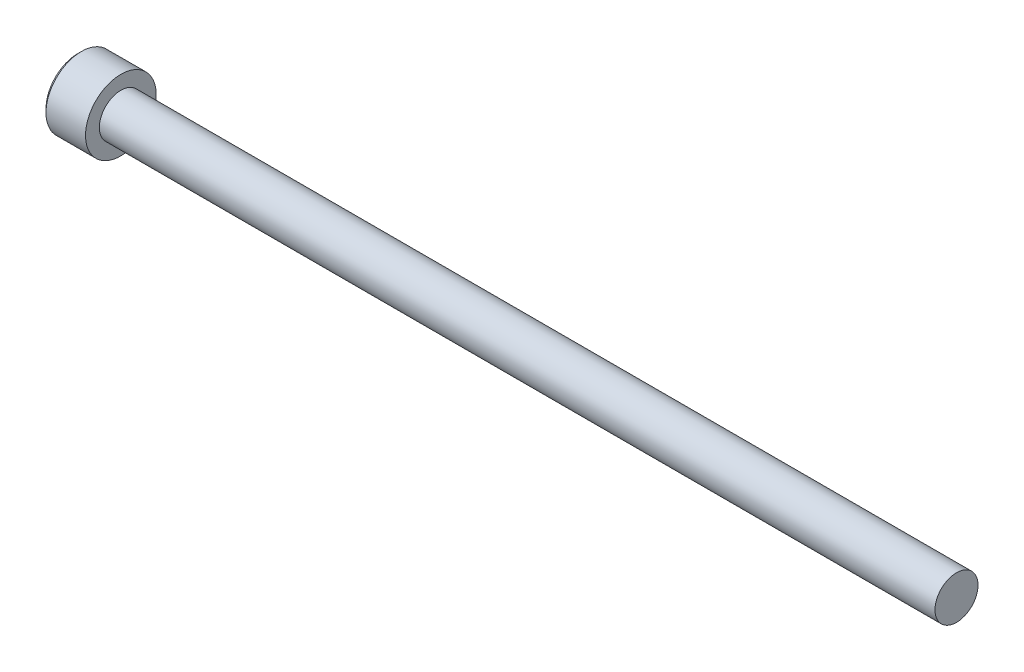
ISO-10303-21;
HEADER;
FILE_DESCRIPTION(('STEP AP214'),'2;1');
FILE_NAME('part.step','',(''),(''),'','','');
FILE_SCHEMA(('AUTOMOTIVE_DESIGN { 1 0 10303 214 1 1 1 1 }'));
ENDSEC;
DATA;
#1=APPLICATION_CONTEXT('core data for automotive mechanical design processes');
#2=APPLICATION_PROTOCOL_DEFINITION('international standard','automotive_design',2000,#1);
#3=PRODUCT_CONTEXT('',#1,'mechanical');
#4=PRODUCT('Part','Part','',(#3));
#5=PRODUCT_RELATED_PRODUCT_CATEGORY('part','',(#4));
#6=PRODUCT_DEFINITION_FORMATION('','',#4);
#7=PRODUCT_DEFINITION_CONTEXT('part definition',#1,'design');
#8=PRODUCT_DEFINITION('design','',#6,#7);
#9=PRODUCT_DEFINITION_SHAPE('','',#8);
#10=(LENGTH_UNIT() NAMED_UNIT(*) SI_UNIT(.MILLI.,.METRE.));
#11=(NAMED_UNIT(*) PLANE_ANGLE_UNIT() SI_UNIT($,.RADIAN.));
#12=(NAMED_UNIT(*) SI_UNIT($,.STERADIAN.) SOLID_ANGLE_UNIT());
#13=UNCERTAINTY_MEASURE_WITH_UNIT(LENGTH_MEASURE(1.E-05),#10,'distance_accuracy_value','');
#14=(GEOMETRIC_REPRESENTATION_CONTEXT(3) GLOBAL_UNCERTAINTY_ASSIGNED_CONTEXT((#13)) GLOBAL_UNIT_ASSIGNED_CONTEXT((#10,
#11,#12)) REPRESENTATION_CONTEXT('',''));
#15=CARTESIAN_POINT('',(0.,0.,0.));
#16=DIRECTION('',(0.,0.,1.));
#17=DIRECTION('',(1.,0.,0.));
#18=AXIS2_PLACEMENT_3D('',#15,#16,#17);
#19=CARTESIAN_POINT('',(-2.28600000000007,-1.14567944042317,1.984375));
#20=DIRECTION('',(0.,0.,1.));
#21=DIRECTION('',(1.,0.,0.));
#22=AXIS2_PLACEMENT_3D('',#19,#20,#21);
#23=PLANE('',#22);
#24=CARTESIAN_POINT('',(-4.82599999995852,1.14567944044653,1.98437499999554));
#25=CARTESIAN_POINT('',(-4.78691618362732,1.06743880343266,1.9843749999984));
#26=CARTESIAN_POINT('',(-4.75011447684892,0.987898318960917,1.98437499999957));
#27=CARTESIAN_POINT('',(-4.68265620500518,0.825677042028778,1.98437500000043));
#28=CARTESIAN_POINT('',(-4.65204056061138,0.742979382529199,1.98437500000012));
#29=CARTESIAN_POINT('',(-4.5991739228306,0.575193959555969,1.98437499999988));
#30=CARTESIAN_POINT('',(-4.57689462080725,0.490115359117279,1.98437499999997));
#31=CARTESIAN_POINT('',(-4.54259467221837,0.318093091130193,1.98437500000003));
#32=CARTESIAN_POINT('',(-4.5305423022885,0.231156054976726,1.984375));
#33=CARTESIAN_POINT('',(-4.52249110263747,0.119918521511051,1.984375));
#34=CARTESIAN_POINT('',(-4.52118947557477,0.0959468443046798,1.984375));
#35=CARTESIAN_POINT('',(-4.51945182629813,0.0479845644411998,1.984375));
#36=CARTESIAN_POINT('',(-4.51901533386223,0.0239939791589393,1.984375));
#37=CARTESIAN_POINT('',(-4.51901809008399,-0.0602201717457363,1.984375));
#38=CARTESIAN_POINT('',(-4.52177452299902,-0.120461721905447,1.984375));
#39=CARTESIAN_POINT('',(-4.5326365512493,-0.240474970989197,1.984375));
#40=CARTESIAN_POINT('',(-4.54074587749718,-0.300246312758427,1.984375));
#41=CARTESIAN_POINT('',(-4.57259622946939,-0.478763752804282,1.984375));
#42=CARTESIAN_POINT('',(-4.60385422611702,-0.596208828937734,1.984375));
#43=CARTESIAN_POINT('',(-4.66780003592237,-0.785921487441256,1.984375));
#44=CARTESIAN_POINT('',(-4.69623457768558,-0.859734609866899,1.984375));
#45=CARTESIAN_POINT('',(-4.75786140400812,-1.00456595519282,1.984375));
#46=CARTESIAN_POINT('',(-4.79100779300359,-1.07560356657101,1.984375));
#47=CARTESIAN_POINT('',(-4.82599999995643,-1.14567944044724,1.984375));
#48=B_SPLINE_CURVE_WITH_KNOTS('',3,(#24,#25,#26,#27,#28,#29,#30,#31,#32,#33,#34,#35,#36,#37,#38,
#39,#40,#41,#42,#43,#44,#45,#46,#47),.UNSPECIFIED.,.F.,.F.,(4,2,2,2,2,2,2,2,2,2,2,4),(0.,
0.262559005207405,0.526801735838036,0.790138824405318,1.05265603861765,1.12466619182083,
1.19663719499031,1.3772702672652,1.55802937209382,1.92104085090328,2.15819130092264,
2.39317265078575),.UNSPECIFIED.);
#49=CARTESIAN_POINT('',(-4.82599999996829,1.14567944041753,1.98437500003084));
#50=VERTEX_POINT('',#49);
#51=CARTESIAN_POINT('',(-4.8259999999622,-1.14567944043207,1.98437500001542));
#52=VERTEX_POINT('',#51);
#53=EDGE_CURVE('E21',#50,#52,#48,.T.);
#54=ORIENTED_EDGE('',*,*,#53,.F.);
#55=DIRECTION('',(1.,0.,0.));
#56=VECTOR('',#55,1.);
#57=CARTESIAN_POINT('',(-2.28600000000007,1.14567944042316,1.984375));
#58=LINE('',#57,#56);
#59=CARTESIAN_POINT('',(-2.28600000000007,1.14567944042316,1.984375));
#60=VERTEX_POINT('',#59);
#61=EDGE_CURVE('E69',#50,#60,#58,.T.);
#62=ORIENTED_EDGE('',*,*,#61,.T.);
#63=DIRECTION('',(0.,1.,0.));
#64=VECTOR('',#63,1.);
#65=CARTESIAN_POINT('',(-2.28600000000007,0.,1.984375));
#66=LINE('',#65,#64);
#67=CARTESIAN_POINT('',(-2.28600000000007,-1.14567944042317,1.984375));
#68=VERTEX_POINT('',#67);
#69=EDGE_CURVE('E75',#68,#60,#66,.T.);
#70=ORIENTED_EDGE('',*,*,#69,.F.);
#71=DIRECTION('',(1.,0.,0.));
#72=VECTOR('',#71,1.);
#73=CARTESIAN_POINT('',(-2.28600000000007,-1.14567944042317,1.984375));
#74=LINE('',#73,#72);
#75=EDGE_CURVE('E72',#68,#52,#74,.F.);
#76=ORIENTED_EDGE('',*,*,#75,.T.);
#77=EDGE_LOOP('',(#54,#62,#70,#76));
#78=FACE_BOUND('',#77,.T.);
#79=ADVANCED_FACE('F17',(#78),#23,.F.);
#80=CARTESIAN_POINT('',(-2.28600000000007,0.,0.));
#81=DIRECTION('',(-1.,0.,0.));
#82=DIRECTION('',(0.,0.,1.));
#83=AXIS2_PLACEMENT_3D('',#80,#81,#82);
#84=PLANE('',#83);
#85=DIRECTION('',(0.,0.5,0.866025403784439));
#86=VECTOR('',#85,1.);
#87=CARTESIAN_POINT('',(-2.28600000000007,2.29135888084633,0.));
#88=LINE('',#87,#86);
#89=CARTESIAN_POINT('',(-2.28600000000007,2.29135888084633,0.));
#90=VERTEX_POINT('',#89);
#91=CARTESIAN_POINT('',(-2.28600000000007,1.14567944042316,-1.984375));
#92=VERTEX_POINT('',#91);
#93=EDGE_CURVE('E83',#90,#92,#88,.F.);
#94=ORIENTED_EDGE('',*,*,#93,.T.);
#95=DIRECTION('',(0.,1.,0.));
#96=VECTOR('',#95,1.);
#97=CARTESIAN_POINT('',(-2.28600000000007,1.14567944042316,-1.984375));
#98=LINE('',#97,#96);
#99=CARTESIAN_POINT('',(-2.28600000000007,-1.14567944042316,-1.984375));
#100=VERTEX_POINT('',#99);
#101=EDGE_CURVE('E243',#92,#100,#98,.F.);
#102=ORIENTED_EDGE('',*,*,#101,.T.);
#103=DIRECTION('',(0.,0.5,-0.866025403784439));
#104=VECTOR('',#103,1.);
#105=CARTESIAN_POINT('',(-2.28600000000007,-1.14567944042316,-1.984375));
#106=LINE('',#105,#104);
#107=CARTESIAN_POINT('',(-2.28600000000007,-2.29135888084633,0.));
#108=VERTEX_POINT('',#107);
#109=EDGE_CURVE('E228',#100,#108,#106,.F.);
#110=ORIENTED_EDGE('',*,*,#109,.T.);
#111=DIRECTION('',(0.,-0.5,-0.866025403784439));
#112=VECTOR('',#111,1.);
#113=CARTESIAN_POINT('',(-2.28600000000007,-2.29135888084633,0.));
#114=LINE('',#113,#112);
#115=EDGE_CURVE('E225',#108,#68,#114,.F.);
#116=ORIENTED_EDGE('',*,*,#115,.T.);
#117=ORIENTED_EDGE('',*,*,#69,.T.);
#118=DIRECTION('',(0.,-0.5,0.866025403784439));
#119=VECTOR('',#118,1.);
#120=CARTESIAN_POINT('',(-2.28600000000007,1.14567944042316,1.984375));
#121=LINE('',#120,#119);
#122=EDGE_CURVE('E82',#60,#90,#121,.F.);
#123=ORIENTED_EDGE('',*,*,#122,.T.);
#124=EDGE_LOOP('',(#94,#102,#110,#116,#117,#123));
#125=FACE_BOUND('',#124,.T.);
#126=ADVANCED_FACE('F161',(#125),#84,.T.);
#127=CARTESIAN_POINT('',(-2.28600000000007,-1.14567944042316,-1.984375));
#128=DIRECTION('',(0.,-0.866025403784439,-0.5));
#129=DIRECTION('',(0.,0.5,-0.866025403784439));
#130=AXIS2_PLACEMENT_3D('',#127,#128,#129);
#131=PLANE('',#130);
#132=CARTESIAN_POINT('',(-4.82599999995871,-1.14567944040756,-1.98437500001887));
#133=CARTESIAN_POINT('',(-4.78666022792997,-1.18505700230148,-1.91617106214563));
#134=CARTESIAN_POINT('',(-4.74963132844072,-1.22509295783734,-1.8468267530301));
#135=CARTESIAN_POINT('',(-4.68183299424977,-1.30673037975396,-1.70542659047317));
#136=CARTESIAN_POINT('',(-4.65110127019237,-1.34833960561553,-1.63335729721673));
#137=CARTESIAN_POINT('',(-4.59845762010516,-1.432242568594,-1.48803310243203));
#138=CARTESIAN_POINT('',(-4.57641341195893,-1.47451494967301,-1.41481519064643));
#139=CARTESIAN_POINT('',(-4.54245011067441,-1.55999007976842,-1.26676792253773));
#140=CARTESIAN_POINT('',(-4.53050567471972,-1.6031902195197,-1.19194308559438));
#141=CARTESIAN_POINT('',(-4.51972842752365,-1.67764765054852,-1.06297903205139));
#142=CARTESIAN_POINT('',(-4.51813352794834,-1.70880881707173,-1.00900630841009));
#143=CARTESIAN_POINT('',(-4.52082392138599,-1.77108016542046,-0.901149169214274));
#144=CARTESIAN_POINT('',(-4.52511127545884,-1.80219032554946,-0.847264791239237));
#145=CARTESIAN_POINT('',(-4.53932219421538,-1.86411684097343,-0.740004920189235));
#146=CARTESIAN_POINT('',(-4.54925206045723,-1.8949328285454,-0.686630064029166));
#147=CARTESIAN_POINT('',(-4.5742029484467,-1.95603190279815,-0.580803363127978));
#148=CARTESIAN_POINT('',(-4.58922357974385,-1.98631503016081,-0.528351447923769));
#149=CARTESIAN_POINT('',(-4.63380478900425,-2.06386502548479,-0.394030915895904));
#150=CARTESIAN_POINT('',(-4.66672213384104,-2.11065153226583,-0.312994309042484));
#151=CARTESIAN_POINT('',(-4.72228952038986,-2.17944749410732,-0.193836207777459));
#152=CARTESIAN_POINT('',(-4.74181309375939,-2.20211890802843,-0.154568166986659));
#153=CARTESIAN_POINT('',(-4.78263970065987,-2.24704195201531,-0.0767591723707469));
#154=CARTESIAN_POINT('',(-4.80394164363173,-2.2692938292399,-0.0382177904539708));
#155=CARTESIAN_POINT('',(-4.82599999995675,-2.29135888085868,2.13931096265935E-11));
#156=B_SPLINE_CURVE_WITH_KNOTS('',3,(#132,#133,#134,#135,#136,#137,#138,#139,#140,#141,#142,
#143,#144,#145,#146,#147,#148,#149,#150,#151,#152,#153,#154,#155),.UNSPECIFIED.,.F.,.F.,(4,2,2,
2,2,2,2,2,2,2,2,4),(0.,0.264284909626495,0.530108996358094,0.791712695414128,1.05265800174404,
1.23942150116703,1.42625045663858,1.61328847394198,1.80031214908683,2.09727151182814,
2.24534838946042,2.39333511890876),.UNSPECIFIED.);
#157=CARTESIAN_POINT('',(-4.8259999999622,-1.14567944043207,-1.98437500001542));
#158=VERTEX_POINT('',#157);
#159=CARTESIAN_POINT('',(-4.82599999996846,-2.2913588808704,-2.00043543490866E-11));
#160=VERTEX_POINT('',#159);
#161=EDGE_CURVE('E163',#158,#160,#156,.T.);
#162=ORIENTED_EDGE('',*,*,#161,.T.);
#163=DIRECTION('',(1.,0.,0.));
#164=VECTOR('',#163,1.);
#165=CARTESIAN_POINT('',(-2.28600000000007,-2.29135888084633,0.));
#166=LINE('',#165,#164);
#167=EDGE_CURVE('E236',#160,#108,#166,.T.);
#168=ORIENTED_EDGE('',*,*,#167,.T.);
#169=ORIENTED_EDGE('',*,*,#109,.F.);
#170=DIRECTION('',(-1.,0.,0.));
#171=VECTOR('',#170,1.);
#172=CARTESIAN_POINT('',(-2.28600000000007,-1.14567944042316,-1.984375));
#173=LINE('',#172,#171);
#174=EDGE_CURVE('E246',#100,#158,#173,.T.);
#175=ORIENTED_EDGE('',*,*,#174,.T.);
#176=EDGE_LOOP('',(#162,#168,#169,#175));
#177=FACE_BOUND('',#176,.T.);
#178=ADVANCED_FACE('F157',(#177),#131,.F.);
#179=CARTESIAN_POINT('',(-2.28600000000007,-2.29135888084633,0.));
#180=DIRECTION('',(0.,-0.866025403784439,0.5));
#181=DIRECTION('',(0.,-0.5,-0.866025403784439));
#182=AXIS2_PLACEMENT_3D('',#179,#180,#181);
#183=PLANE('',#182);
#184=CARTESIAN_POINT('',(-4.8259999999587,-2.29135888085486,-2.29477011545215E-11));
#185=CARTESIAN_POINT('',(-4.78666022792997,-2.25198131896546,0.0682039378529047));
#186=CARTESIAN_POINT('',(-4.74963132844072,-2.21194536343147,0.137548246969502));
#187=CARTESIAN_POINT('',(-4.68183299424977,-2.13030794151622,0.278948409527228));
#188=CARTESIAN_POINT('',(-4.65110127019237,-2.08869871565414,0.351017702783377));
#189=CARTESIAN_POINT('',(-4.59845762010516,-2.00479575267531,0.496341897567867));
#190=CARTESIAN_POINT('',(-4.57641341195893,-1.96252337159644,0.569559809353539));
#191=CARTESIAN_POINT('',(-4.5424501106744,-1.87704824150112,0.717607077462299));
#192=CARTESIAN_POINT('',(-4.53050567471972,-1.8338481017498,0.792431914405622));
#193=CARTESIAN_POINT('',(-4.51972842752365,-1.75939067072096,0.921395967948603));
#194=CARTESIAN_POINT('',(-4.51813352794834,-1.72822950419776,0.975368691589913));
#195=CARTESIAN_POINT('',(-4.52082392138599,-1.66595815584903,1.08322583078573));
#196=CARTESIAN_POINT('',(-4.52511127545884,-1.63484799572003,1.13711020876076));
#197=CARTESIAN_POINT('',(-4.53932219421538,-1.57292148029607,1.24437007981077));
#198=CARTESIAN_POINT('',(-4.54925206045723,-1.54210549272409,1.29774493597084));
#199=CARTESIAN_POINT('',(-4.5742029484467,-1.48100641847134,1.40357163687202));
#200=CARTESIAN_POINT('',(-4.58922357974385,-1.45072329110868,1.45602355207623));
#201=CARTESIAN_POINT('',(-4.63380478900421,-1.37317329578476,1.59034408410398));
#202=CARTESIAN_POINT('',(-4.66672213384095,-1.32638678900379,1.6713806909573));
#203=CARTESIAN_POINT('',(-4.72228952038968,-1.25759082716239,1.79053879222216));
#204=CARTESIAN_POINT('',(-4.74181309375917,-1.23491941324131,1.82980683301291));
#205=CARTESIAN_POINT('',(-4.78263970065959,-1.18999636925449,1.90761582762873));
#206=CARTESIAN_POINT('',(-4.8039416436314,-1.16774449202993,1.94615720954545));
#207=CARTESIAN_POINT('',(-4.82599999995639,-1.14567944041117,1.98437500002077));
#208=B_SPLINE_CURVE_WITH_KNOTS('',3,(#184,#185,#186,#187,#188,#189,#190,#191,#192,#193,#194,
#195,#196,#197,#198,#199,#200,#201,#202,#203,#204,#205,#206,#207),.UNSPECIFIED.,.F.,.F.,(4,2,2,
2,2,2,2,2,2,2,2,4),(0.,0.264284909626493,0.530108996358089,0.791712695414125,1.05265800174404,
1.23942150116703,1.42625045663858,1.61328847394198,1.80031214908683,2.09727151182773,
2.24534838945981,2.39333511890795),.UNSPECIFIED.);
#209=EDGE_CURVE('E92',#160,#52,#208,.T.);
#210=ORIENTED_EDGE('',*,*,#209,.T.);
#211=ORIENTED_EDGE('',*,*,#75,.F.);
#212=ORIENTED_EDGE('',*,*,#115,.F.);
#213=ORIENTED_EDGE('',*,*,#167,.F.);
#214=EDGE_LOOP('',(#210,#211,#212,#213));
#215=FACE_BOUND('',#214,.T.);
#216=ADVANCED_FACE('F152',(#215),#183,.F.);
#217=CARTESIAN_POINT('',(-2.28600000000007,1.14567944042316,1.984375));
#218=DIRECTION('',(0.,0.866025403784439,0.5));
#219=DIRECTION('',(0.,-0.5,0.866025403784439));
#220=AXIS2_PLACEMENT_3D('',#217,#218,#219);
#221=PLANE('',#220);
#222=CARTESIAN_POINT('',(-4.82599999995852,1.14567944040762,1.98437500001801));
#223=CARTESIAN_POINT('',(-4.78666022792973,1.1850570023017,1.91617106214498));
#224=CARTESIAN_POINT('',(-4.74963132844047,1.22509295783761,1.84682675302957));
#225=CARTESIAN_POINT('',(-4.68183299424957,1.30673037975422,1.70542659047278));
#226=CARTESIAN_POINT('',(-4.65110127019222,1.34833960561574,1.63335729721638));
#227=CARTESIAN_POINT('',(-4.59845762010509,1.43224256859413,1.48803310243178));
#228=CARTESIAN_POINT('',(-4.57641341195888,1.47451494967311,1.41481519064625));
#229=CARTESIAN_POINT('',(-4.54245011067439,1.55999007976846,1.26676792253767));
#230=CARTESIAN_POINT('',(-4.53050567471972,1.6031902195197,1.19194308559439));
#231=CARTESIAN_POINT('',(-4.51972842752365,1.67764765054848,1.06297903205146));
#232=CARTESIAN_POINT('',(-4.51813352794835,1.70880881707169,1.00900630841016));
#233=CARTESIAN_POINT('',(-4.52082392138598,1.77108016542041,0.901149169214364));
#234=CARTESIAN_POINT('',(-4.52511127545883,1.80219032554941,0.847264791239333));
#235=CARTESIAN_POINT('',(-4.53932219421536,1.86411684097336,0.740004920189342));
#236=CARTESIAN_POINT('',(-4.54925206045721,1.89493282854533,0.686630064029278));
#237=CARTESIAN_POINT('',(-4.57420294844667,1.95603190279808,0.5808033631281));
#238=CARTESIAN_POINT('',(-4.58922357974382,1.98631503016074,0.528351447923897));
#239=CARTESIAN_POINT('',(-4.6338047890042,2.06386502548473,0.394030915896012));
#240=CARTESIAN_POINT('',(-4.666722133841,2.11065153226578,0.312994309042568));
#241=CARTESIAN_POINT('',(-4.72228952038984,2.17944749410729,0.19383620777751));
#242=CARTESIAN_POINT('',(-4.74181309375937,2.20211890802841,0.1545681669867));
#243=CARTESIAN_POINT('',(-4.78263970065986,2.24704195201529,0.0767591723707674));
#244=CARTESIAN_POINT('',(-4.80394164363172,2.26929382923989,0.0382177904539813));
#245=CARTESIAN_POINT('',(-4.82599999995675,2.29135888085868,-2.1392886942985E-11));
#246=B_SPLINE_CURVE_WITH_KNOTS('',3,(#222,#223,#224,#225,#226,#227,#228,#229,#230,#231,#232,
#233,#234,#235,#236,#237,#238,#239,#240,#241,#242,#243,#244,#245),.UNSPECIFIED.,.F.,.F.,(4,2,2,
2,2,2,2,2,2,2,2,4),(0.,0.26428490962629,0.530108996357672,0.791712695413487,1.05265800174319,
1.23942150116616,1.42625045663768,1.61328847394106,1.80031214908589,2.09727151182728,
2.2453483894596,2.39333511890798),.UNSPECIFIED.);
#247=CARTESIAN_POINT('',(-4.82599999996846,2.29135888087039,2.00042061038936E-11));
#248=VERTEX_POINT('',#247);
#249=EDGE_CURVE('E80',#50,#248,#246,.T.);
#250=ORIENTED_EDGE('',*,*,#249,.T.);
#251=DIRECTION('',(1.,0.,0.));
#252=VECTOR('',#251,1.);
#253=CARTESIAN_POINT('',(-2.28600000000007,2.29135888084633,0.));
#254=LINE('',#253,#252);
#255=EDGE_CURVE('E247',#248,#90,#254,.T.);
#256=ORIENTED_EDGE('',*,*,#255,.T.);
#257=ORIENTED_EDGE('',*,*,#122,.F.);
#258=ORIENTED_EDGE('',*,*,#61,.F.);
#259=EDGE_LOOP('',(#250,#256,#257,#258));
#260=FACE_BOUND('',#259,.T.);
#261=ADVANCED_FACE('F77',(#260),#221,.F.);
#262=CARTESIAN_POINT('',(-2.28600000000007,2.29135888084633,0.));
#263=DIRECTION('',(0.,0.866025403784439,-0.5));
#264=DIRECTION('',(0.,0.5,0.866025403784439));
#265=AXIS2_PLACEMENT_3D('',#262,#263,#264);
#266=PLANE('',#265);
#267=CARTESIAN_POINT('',(-4.82599999995871,2.29135888085486,2.29489280696874E-11));
#268=CARTESIAN_POINT('',(-4.78666022792997,2.25198131896547,-0.0682039378529039));
#269=CARTESIAN_POINT('',(-4.74963132844072,2.21194536343147,-0.137548246969502));
#270=CARTESIAN_POINT('',(-4.68183299424977,2.13030794151622,-0.278948409527229));
#271=CARTESIAN_POINT('',(-4.65110127019237,2.08869871565414,-0.351017702783379));
#272=CARTESIAN_POINT('',(-4.59845762010516,2.00479575267531,-0.496341897567869));
#273=CARTESIAN_POINT('',(-4.57641341195893,1.96252337159644,-0.569559809353541));
#274=CARTESIAN_POINT('',(-4.5424501106744,1.87704824150112,-0.7176070774623));
#275=CARTESIAN_POINT('',(-4.53050567471972,1.8338481017498,-0.792431914405622));
#276=CARTESIAN_POINT('',(-4.51972842752365,1.75939067072096,-0.921395967948603));
#277=CARTESIAN_POINT('',(-4.51813352794834,1.72822950419776,-0.975368691589912));
#278=CARTESIAN_POINT('',(-4.52082392138599,1.66595815584903,-1.08322583078573));
#279=CARTESIAN_POINT('',(-4.52511127545884,1.63484799572003,-1.13711020876076));
#280=CARTESIAN_POINT('',(-4.53932219421538,1.57292148029607,-1.24437007981077));
#281=CARTESIAN_POINT('',(-4.54925206045723,1.54210549272409,-1.29774493597083));
#282=CARTESIAN_POINT('',(-4.5742029484467,1.48100641847134,-1.40357163687202));
#283=CARTESIAN_POINT('',(-4.58922357974385,1.45072329110868,-1.45602355207623));
#284=CARTESIAN_POINT('',(-4.63380478900425,1.3731732957847,-1.5903440841041));
#285=CARTESIAN_POINT('',(-4.66672213384104,1.32638678900366,-1.67138069095752));
#286=CARTESIAN_POINT('',(-4.72228952038986,1.25759082716218,-1.79053879222254));
#287=CARTESIAN_POINT('',(-4.74181309375939,1.23491941324106,-1.82980683301334));
#288=CARTESIAN_POINT('',(-4.78263970065987,1.18999636925419,-1.90761582762925));
#289=CARTESIAN_POINT('',(-4.80394164363173,1.1677444920296,-1.94615720954603));
#290=CARTESIAN_POINT('',(-4.82599999995675,1.14567944041081,-1.98437500002139));
#291=B_SPLINE_CURVE_WITH_KNOTS('',3,(#267,#268,#269,#270,#271,#272,#273,#274,#275,#276,#277,
#278,#279,#280,#281,#282,#283,#284,#285,#286,#287,#288,#289,#290),.UNSPECIFIED.,.F.,.F.,(4,2,2,
2,2,2,2,2,2,2,2,4),(0.,0.264284909626495,0.530108996358093,0.791712695414127,1.05265800174404,
1.23942150116703,1.42625045663858,1.61328847394198,1.80031214908683,2.09727151182814,
2.24534838946042,2.39333511890876),.UNSPECIFIED.);
#292=CARTESIAN_POINT('',(-4.82599999996846,1.14567944045252,-1.98437500001084));
#293=VERTEX_POINT('',#292);
#294=EDGE_CURVE('E40',#248,#293,#291,.T.);
#295=ORIENTED_EDGE('',*,*,#294,.T.);
#296=DIRECTION('',(-1.,0.,0.));
#297=VECTOR('',#296,1.);
#298=CARTESIAN_POINT('',(-2.28600000000007,1.14567944042316,-1.984375));
#299=LINE('',#298,#297);
#300=EDGE_CURVE('E167',#293,#92,#299,.F.);
#301=ORIENTED_EDGE('',*,*,#300,.T.);
#302=ORIENTED_EDGE('',*,*,#93,.F.);
#303=ORIENTED_EDGE('',*,*,#255,.F.);
#304=EDGE_LOOP('',(#295,#301,#302,#303));
#305=FACE_BOUND('',#304,.T.);
#306=ADVANCED_FACE('F151',(#305),#266,.F.);
#307=CARTESIAN_POINT('',(-2.28600000000007,1.14567944042316,-1.984375));
#308=DIRECTION('',(0.,0.,-1.));
#309=DIRECTION('',(-1.,0.,0.));
#310=AXIS2_PLACEMENT_3D('',#307,#308,#309);
#311=PLANE('',#310);
#312=CARTESIAN_POINT('',(-4.8259999999587,1.14567944044731,-1.98437499999592));
#313=CARTESIAN_POINT('',(-4.78666022793094,1.06692431665146,-1.98437499999853));
#314=CARTESIAN_POINT('',(-4.74963132844318,0.986852405569011,-1.98437499999961));
#315=CARTESIAN_POINT('',(-4.6818329942566,0.823577561711963,-1.9843750000004));
#316=CARTESIAN_POINT('',(-4.65110127020207,0.740359109975722,-1.98437500000011));
#317=CARTESIAN_POINT('',(-4.59845762012233,0.572553183993917,-1.9843749999999));
#318=CARTESIAN_POINT('',(-4.57641341198063,0.488008421824127,-1.98437499999997));
#319=CARTESIAN_POINT('',(-4.54245011070673,0.317058161610178,-1.98437500000003));
#320=CARTESIAN_POINT('',(-4.53050567475816,0.230657882096267,-1.98437500000001));
#321=CARTESIAN_POINT('',(-4.51972842757294,0.0817430200124032,-1.984375));
#322=CARTESIAN_POINT('',(-4.51813352800283,0.0194206869508218,-1.984375));
#323=CARTESIAN_POINT('',(-4.52082392145254,-0.1051220097764,-1.984375));
#324=CARTESIAN_POINT('',(-4.52511127553227,-0.167342330049008,-1.984375));
#325=CARTESIAN_POINT('',(-4.53932219430377,-0.291195360925477,-1.984375));
#326=CARTESIAN_POINT('',(-4.54925206055372,-0.352827336083362,-1.984375));
#327=CARTESIAN_POINT('',(-4.57420294856008,-0.475025484616114,-1.984375));
#328=CARTESIAN_POINT('',(-4.58922357986604,-0.535591739354747,-1.984375));
#329=CARTESIAN_POINT('',(-4.63380478912724,-0.690691729958653,-1.984375));
#330=CARTESIAN_POINT('',(-4.66672213394715,-0.784264743465576,-1.984375));
#331=CARTESIAN_POINT('',(-4.7222895204619,-0.921856667069616,-1.984375));
#332=CARTESIAN_POINT('',(-4.74181309381856,-0.967199494886089,-1.984375));
#333=CARTESIAN_POINT('',(-4.78263970069104,-1.05704558280959,-1.984375));
#334=CARTESIAN_POINT('',(-4.80394164364776,-1.10154933723428,-1.984375));
#335=CARTESIAN_POINT('',(-4.82599999995675,-1.14567944044787,-1.984375));
#336=B_SPLINE_CURVE_WITH_KNOTS('',3,(#312,#313,#314,#315,#316,#317,#318,#319,#320,#321,#322,
#323,#324,#325,#326,#327,#328,#329,#330,#331,#332,#333,#334,#335),.UNSPECIFIED.,.F.,.F.,(4,2,2,
2,2,2,2,2,2,2,2,4),(0.,0.264284909658836,0.530108996422784,0.791712695509868,1.0526580018708,
1.23942150133878,1.42625045685537,1.61328847420389,1.80031214939384,2.09727151196384,
2.24534838950992,2.39333511887245),.UNSPECIFIED.);
#337=EDGE_CURVE('E109',#293,#158,#336,.T.);
#338=ORIENTED_EDGE('',*,*,#337,.T.);
#339=ORIENTED_EDGE('',*,*,#174,.F.);
#340=ORIENTED_EDGE('',*,*,#101,.F.);
#341=ORIENTED_EDGE('',*,*,#300,.F.);
#342=EDGE_LOOP('',(#338,#339,#340,#341));
#343=FACE_BOUND('',#342,.T.);
#344=ADVANCED_FACE('F122',(#343),#311,.F.);
#345=CARTESIAN_POINT('',(-4.82599999998001,0.,0.));
#346=DIRECTION('',(-1.,0.,0.));
#347=DIRECTION('',(0.,0.,1.));
#348=AXIS2_PLACEMENT_3D('',#345,#346,#347);
#349=CONICAL_SURFACE('',#348,2.29135888088194,0.785398163397448);
#350=ORIENTED_EDGE('',*,*,#161,.F.);
#351=CARTESIAN_POINT('',(-4.82599999998001,0.,0.));
#352=DIRECTION('',(-1.,0.,0.));
#353=DIRECTION('',(0.,0.,1.));
#354=AXIS2_PLACEMENT_3D('',#351,#352,#353);
#355=CIRCLE('',#354,2.29135888088194);
#356=EDGE_CURVE('E106',#158,#160,#355,.T.);
#357=ORIENTED_EDGE('',*,*,#356,.T.);
#358=EDGE_LOOP('',(#350,#357));
#359=FACE_BOUND('',#358,.T.);
#360=ADVANCED_FACE('F168',(#359),#349,.F.);
#361=CARTESIAN_POINT('',(-4.82599999998001,0.,0.));
#362=DIRECTION('',(-1.,0.,0.));
#363=DIRECTION('',(0.,0.,1.));
#364=AXIS2_PLACEMENT_3D('',#361,#362,#363);
#365=CONICAL_SURFACE('',#364,2.29135888088194,0.785398163397448);
#366=ORIENTED_EDGE('',*,*,#209,.F.);
#367=CARTESIAN_POINT('',(-4.82599999998001,0.,0.));
#368=DIRECTION('',(-1.,0.,0.));
#369=DIRECTION('',(0.,0.,1.));
#370=AXIS2_PLACEMENT_3D('',#367,#368,#369);
#371=CIRCLE('',#370,2.29135888088194);
#372=EDGE_CURVE('E87',#160,#52,#371,.T.);
#373=ORIENTED_EDGE('',*,*,#372,.T.);
#374=EDGE_LOOP('',(#366,#373));
#375=FACE_BOUND('',#374,.T.);
#376=ADVANCED_FACE('F171',(#375),#365,.F.);
#377=CARTESIAN_POINT('',(-4.82599999998001,0.,0.));
#378=DIRECTION('',(-1.,0.,0.));
#379=DIRECTION('',(0.,0.,1.));
#380=AXIS2_PLACEMENT_3D('',#377,#378,#379);
#381=CONICAL_SURFACE('',#380,2.29135888088194,0.78539816348948);
#382=CARTESIAN_POINT('',(-4.82599999998001,0.,0.));
#383=DIRECTION('',(-1.,0.,0.));
#384=DIRECTION('',(0.,0.,1.));
#385=AXIS2_PLACEMENT_3D('',#382,#383,#384);
#386=CIRCLE('',#385,2.29135888088194);
#387=EDGE_CURVE('E60',#52,#50,#386,.T.);
#388=ORIENTED_EDGE('',*,*,#387,.T.);
#389=ORIENTED_EDGE('',*,*,#53,.T.);
#390=EDGE_LOOP('',(#388,#389));
#391=FACE_BOUND('',#390,.T.);
#392=ADVANCED_FACE('F85',(#391),#381,.F.);
#393=CARTESIAN_POINT('',(-4.82599999998001,0.,0.));
#394=DIRECTION('',(-1.,0.,0.));
#395=DIRECTION('',(0.,0.,1.));
#396=AXIS2_PLACEMENT_3D('',#393,#394,#395);
#397=CONICAL_SURFACE('',#396,2.29135888088194,0.785398163397448);
#398=ORIENTED_EDGE('',*,*,#249,.F.);
#399=CARTESIAN_POINT('',(-4.82599999998001,0.,0.));
#400=DIRECTION('',(-1.,0.,0.));
#401=DIRECTION('',(0.,0.,1.));
#402=AXIS2_PLACEMENT_3D('',#399,#400,#401);
#403=CIRCLE('',#402,2.29135888088194);
#404=EDGE_CURVE('E86',#50,#248,#403,.T.);
#405=ORIENTED_EDGE('',*,*,#404,.T.);
#406=EDGE_LOOP('',(#398,#405));
#407=FACE_BOUND('',#406,.T.);
#408=ADVANCED_FACE('F91',(#407),#397,.F.);
#409=CARTESIAN_POINT('',(-4.82599999998001,0.,0.));
#410=DIRECTION('',(-1.,0.,0.));
#411=DIRECTION('',(0.,0.,1.));
#412=AXIS2_PLACEMENT_3D('',#409,#410,#411);
#413=CONICAL_SURFACE('',#412,2.29135888088194,0.785398163397448);
#414=ORIENTED_EDGE('',*,*,#294,.F.);
#415=CARTESIAN_POINT('',(-4.82599999998001,0.,0.));
#416=DIRECTION('',(-1.,0.,0.));
#417=DIRECTION('',(0.,0.,1.));
#418=AXIS2_PLACEMENT_3D('',#415,#416,#417);
#419=CIRCLE('',#418,2.29135888088194);
#420=EDGE_CURVE('E98',#248,#293,#419,.T.);
#421=ORIENTED_EDGE('',*,*,#420,.T.);
#422=EDGE_LOOP('',(#414,#421));
#423=FACE_BOUND('',#422,.T.);
#424=ADVANCED_FACE('F129',(#423),#413,.F.);
#425=CARTESIAN_POINT('',(-4.82599999998001,0.,0.));
#426=DIRECTION('',(-1.,0.,0.));
#427=DIRECTION('',(0.,0.,1.));
#428=AXIS2_PLACEMENT_3D('',#425,#426,#427);
#429=CONICAL_SURFACE('',#428,2.29135888088194,0.785398163489476);
#430=ORIENTED_EDGE('',*,*,#337,.F.);
#431=CARTESIAN_POINT('',(-4.82599999998001,0.,0.));
#432=DIRECTION('',(-1.,0.,0.));
#433=DIRECTION('',(0.,0.,1.));
#434=AXIS2_PLACEMENT_3D('',#431,#432,#433);
#435=CIRCLE('',#434,2.29135888088194);
#436=EDGE_CURVE('E100',#293,#158,#435,.T.);
#437=ORIENTED_EDGE('',*,*,#436,.T.);
#438=EDGE_LOOP('',(#430,#437));
#439=FACE_BOUND('',#438,.T.);
#440=ADVANCED_FACE('F125',(#439),#429,.F.);
#441=CARTESIAN_POINT('',(-4.82600000000007,0.,0.));
#442=DIRECTION('',(1.,0.,0.));
#443=DIRECTION('',(0.,0.,-1.));
#444=AXIS2_PLACEMENT_3D('',#441,#442,#443);
#445=PLANE('',#444);
#446=CARTESIAN_POINT('',(-4.82599999998001,0.,0.));
#447=DIRECTION('',(1.,0.,0.));
#448=DIRECTION('',(0.,0.,-1.));
#449=AXIS2_PLACEMENT_3D('',#446,#447,#448);
#450=CIRCLE('',#449,3.56615999999121);
#451=CARTESIAN_POINT('',(-4.82599999998001,0.,-3.56615999999121));
#452=VERTEX_POINT('',#451);
#453=EDGE_CURVE('E213',#452,#452,#450,.T.);
#454=ORIENTED_EDGE('',*,*,#453,.F.);
#455=EDGE_LOOP('',(#454));
#456=FACE_BOUND('',#455,.T.);
#457=ORIENTED_EDGE('',*,*,#420,.F.);
#458=ORIENTED_EDGE('',*,*,#404,.F.);
#459=ORIENTED_EDGE('',*,*,#387,.F.);
#460=ORIENTED_EDGE('',*,*,#372,.F.);
#461=ORIENTED_EDGE('',*,*,#356,.F.);
#462=ORIENTED_EDGE('',*,*,#436,.F.);
#463=EDGE_LOOP('',(#457,#458,#459,#460,#461,#462));
#464=FACE_BOUND('',#463,.T.);
#465=ADVANCED_FACE('F95',(#456,#464),#445,.F.);
#466=CARTESIAN_POINT('',(-4.42976000010731,0.,0.));
#467=DIRECTION('',(1.,0.,0.));
#468=DIRECTION('',(0.,0.,-1.));
#469=AXIS2_PLACEMENT_3D('',#466,#467,#468);
#470=CONICAL_SURFACE('',#469,3.96239999986392,0.785398163397448);
#471=CARTESIAN_POINT('',(-4.42976000000007,0.,0.));
#472=DIRECTION('',(-1.,0.,0.));
#473=DIRECTION('',(0.,0.,1.));
#474=AXIS2_PLACEMENT_3D('',#471,#472,#473);
#475=CIRCLE('',#474,3.9624);
#476=CARTESIAN_POINT('',(-4.42976000000007,0.,3.9624));
#477=VERTEX_POINT('',#476);
#478=EDGE_CURVE('E210',#477,#477,#475,.F.);
#479=ORIENTED_EDGE('',*,*,#478,.F.);
#480=EDGE_LOOP('',(#479));
#481=FACE_BOUND('',#480,.T.);
#482=ORIENTED_EDGE('',*,*,#453,.T.);
#483=EDGE_LOOP('',(#482));
#484=FACE_BOUND('',#483,.T.);
#485=ADVANCED_FACE('F199',(#481,#484),#470,.T.);
#486=CARTESIAN_POINT('',(-4.82600000000008,0.,0.));
#487=DIRECTION('',(-1.,0.,0.));
#488=DIRECTION('',(0.,0.,1.));
#489=AXIS2_PLACEMENT_3D('',#486,#487,#488);
#490=CYLINDRICAL_SURFACE('',#489,3.9624);
#491=ORIENTED_EDGE('',*,*,#478,.T.);
#492=EDGE_LOOP('',(#491));
#493=FACE_BOUND('',#492,.T.);
#494=CARTESIAN_POINT('',(0.,0.,0.));
#495=DIRECTION('',(-1.,0.,0.));
#496=DIRECTION('',(0.,0.,1.));
#497=AXIS2_PLACEMENT_3D('',#494,#495,#496);
#498=CIRCLE('',#497,3.9624);
#499=CARTESIAN_POINT('',(0.,0.,3.9624));
#500=VERTEX_POINT('',#499);
#501=EDGE_CURVE('E215',#500,#500,#498,.T.);
#502=ORIENTED_EDGE('',*,*,#501,.T.);
#503=EDGE_LOOP('',(#502));
#504=FACE_BOUND('',#503,.T.);
#505=ADVANCED_FACE('F196',(#493,#504),#490,.T.);
#506=CARTESIAN_POINT('',(93.6625,0.,0.));
#507=DIRECTION('',(1.,0.,0.));
#508=DIRECTION('',(0.,0.,-1.));
#509=AXIS2_PLACEMENT_3D('',#506,#507,#508);
#510=PLANE('',#509);
#511=CARTESIAN_POINT('',(93.6625,0.,0.));
#512=DIRECTION('',(-1.,0.,0.));
#513=DIRECTION('',(0.,0.,1.));
#514=AXIS2_PLACEMENT_3D('',#511,#512,#513);
#515=CIRCLE('',#514,2.413);
#516=CARTESIAN_POINT('',(93.6625,0.,2.413));
#517=VERTEX_POINT('',#516);
#518=EDGE_CURVE('E31',#517,#517,#515,.T.);
#519=ORIENTED_EDGE('',*,*,#518,.F.);
#520=EDGE_LOOP('',(#519));
#521=FACE_BOUND('',#520,.T.);
#522=ADVANCED_FACE('F189',(#521),#510,.T.);
#523=CARTESIAN_POINT('',(0.,3.9624,0.));
#524=DIRECTION('',(-1.,0.,0.));
#525=DIRECTION('',(0.,0.,1.));
#526=AXIS2_PLACEMENT_3D('',#523,#524,#525);
#527=PLANE('',#526);
#528=CARTESIAN_POINT('',(0.,0.,0.));
#529=DIRECTION('',(-1.,0.,0.));
#530=DIRECTION('',(0.,0.,1.));
#531=AXIS2_PLACEMENT_3D('',#528,#529,#530);
#532=CIRCLE('',#531,2.413);
#533=CARTESIAN_POINT('',(0.,0.,2.413));
#534=VERTEX_POINT('',#533);
#535=EDGE_CURVE('E11',#534,#534,#532,.F.);
#536=ORIENTED_EDGE('',*,*,#535,.F.);
#537=EDGE_LOOP('',(#536));
#538=FACE_BOUND('',#537,.T.);
#539=ORIENTED_EDGE('',*,*,#501,.F.);
#540=EDGE_LOOP('',(#539));
#541=FACE_BOUND('',#540,.T.);
#542=ADVANCED_FACE('F183',(#538,#541),#527,.F.);
#543=CARTESIAN_POINT('',(93.6625,0.,0.));
#544=DIRECTION('',(-1.,0.,0.));
#545=DIRECTION('',(0.,0.,1.));
#546=AXIS2_PLACEMENT_3D('',#543,#544,#545);
#547=CYLINDRICAL_SURFACE('',#546,2.413);
#548=ORIENTED_EDGE('',*,*,#535,.T.);
#549=EDGE_LOOP('',(#548));
#550=FACE_BOUND('',#549,.T.);
#551=ORIENTED_EDGE('',*,*,#518,.T.);
#552=EDGE_LOOP('',(#551));
#553=FACE_BOUND('',#552,.T.);
#554=ADVANCED_FACE('F181',(#550,#553),#547,.T.);
#555=CLOSED_SHELL('',(#79,#126,#178,#216,#261,#306,#344,#360,#376,#392,#408,#424,#440,#465,#485,
#505,#522,#542,#554));
#556=MANIFOLD_SOLID_BREP('B1',#555);
#557=ADVANCED_BREP_SHAPE_REPRESENTATION('',(#18,#556),#14);
#558=SHAPE_DEFINITION_REPRESENTATION(#9,#557);
ENDSEC;
END-ISO-10303-21;
